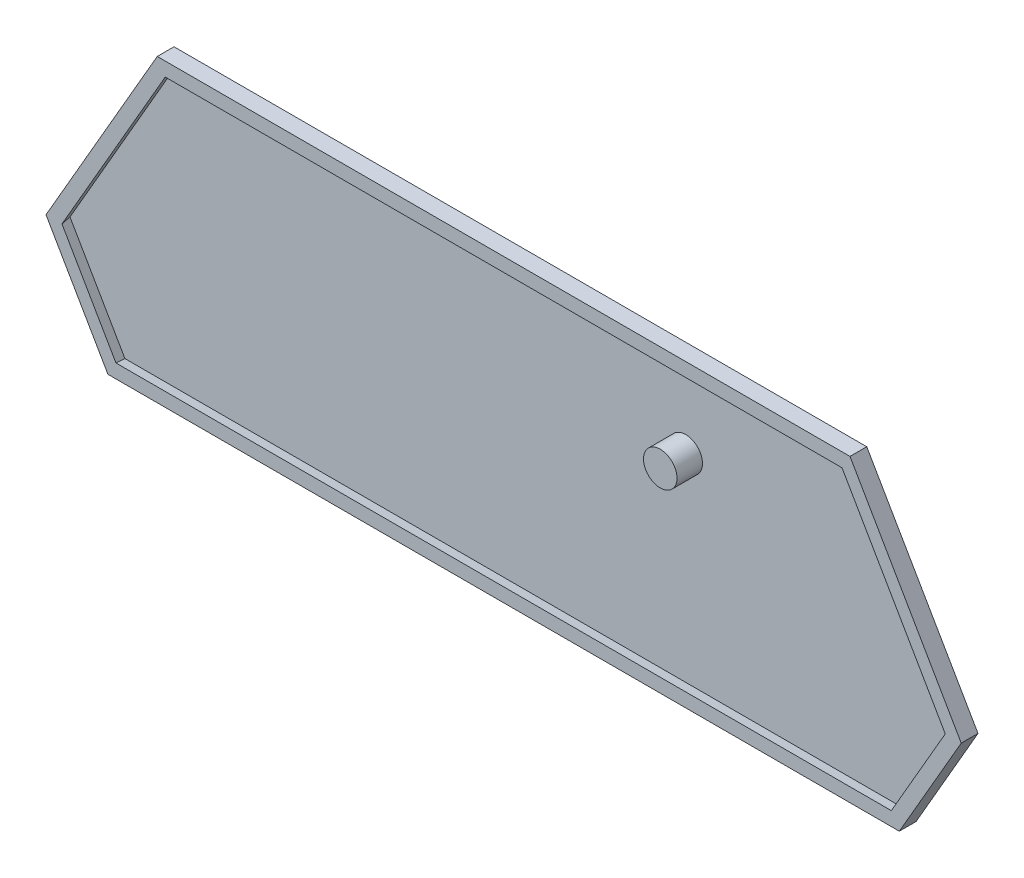
ISO-10303-21;
HEADER;
FILE_DESCRIPTION(('STEP AP214'),'2;1');
FILE_NAME('part.step','',(''),(''),'','','');
FILE_SCHEMA(('AUTOMOTIVE_DESIGN { 1 0 10303 214 1 1 1 1 }'));
ENDSEC;
DATA;
#1=APPLICATION_CONTEXT('core data for automotive mechanical design processes');
#2=APPLICATION_PROTOCOL_DEFINITION('international standard','automotive_design',2000,#1);
#3=PRODUCT_CONTEXT('',#1,'mechanical');
#4=PRODUCT('Part','Part','',(#3));
#5=PRODUCT_RELATED_PRODUCT_CATEGORY('part','',(#4));
#6=PRODUCT_DEFINITION_FORMATION('','',#4);
#7=PRODUCT_DEFINITION_CONTEXT('part definition',#1,'design');
#8=PRODUCT_DEFINITION('design','',#6,#7);
#9=PRODUCT_DEFINITION_SHAPE('','',#8);
#10=(LENGTH_UNIT() NAMED_UNIT(*) SI_UNIT(.MILLI.,.METRE.));
#11=(NAMED_UNIT(*) PLANE_ANGLE_UNIT() SI_UNIT($,.RADIAN.));
#12=(NAMED_UNIT(*) SI_UNIT($,.STERADIAN.) SOLID_ANGLE_UNIT());
#13=UNCERTAINTY_MEASURE_WITH_UNIT(LENGTH_MEASURE(1.E-05),#10,'distance_accuracy_value','');
#14=(GEOMETRIC_REPRESENTATION_CONTEXT(3) GLOBAL_UNCERTAINTY_ASSIGNED_CONTEXT((#13)) GLOBAL_UNIT_ASSIGNED_CONTEXT((#10,
#11,#12)) REPRESENTATION_CONTEXT('',''));
#15=CARTESIAN_POINT('',(0.,0.,0.));
#16=DIRECTION('',(0.,0.,1.));
#17=DIRECTION('',(1.,0.,0.));
#18=AXIS2_PLACEMENT_3D('',#15,#16,#17);
#19=CARTESIAN_POINT('',(0.,0.,2.5));
#20=DIRECTION('',(0.,0.,1.));
#21=DIRECTION('',(1.,0.,0.));
#22=AXIS2_PLACEMENT_3D('',#19,#20,#21);
#23=PLANE('',#22);
#24=DIRECTION('',(0.5,-0.866025403784438,0.));
#25=VECTOR('',#24,1.);
#26=CARTESIAN_POINT('',(-66.4744944991547,-27.7124006266647,2.5));
#27=LINE('',#26,#25);
#28=CARTESIAN_POINT('',(-65.878527434551,-28.7446458621961,2.5));
#29=VERTEX_POINT('',#28);
#30=CARTESIAN_POINT('',(-57.8328572567245,-42.6801553911334,2.5));
#31=VERTEX_POINT('',#30);
#32=EDGE_CURVE('E259',#29,#31,#27,.T.);
#33=ORIENTED_EDGE('',*,*,#32,.F.);
#34=DIRECTION('',(-0.499999999999999,-0.866025403784439,0.));
#35=VECTOR('',#34,1.);
#36=CARTESIAN_POINT('',(-49.8787654728555,-1.03224523553143,2.5));
#37=LINE('',#36,#35);
#38=CARTESIAN_POINT('',(-50.4747325374592,-2.06449047106278,2.5));
#39=VERTEX_POINT('',#38);
#40=EDGE_CURVE('E237',#39,#29,#37,.T.);
#41=ORIENTED_EDGE('',*,*,#40,.F.);
#42=DIRECTION('',(-1.,0.,0.));
#43=VECTOR('',#42,1.);
#44=CARTESIAN_POINT('',(51.6666666666667,-2.06449047106266,2.5));
#45=LINE('',#44,#43);
#46=CARTESIAN_POINT('',(50.4747325374592,-2.06449047106267,2.5));
#47=VERTEX_POINT('',#46);
#48=EDGE_CURVE('E242',#47,#39,#45,.T.);
#49=ORIENTED_EDGE('',*,*,#48,.F.);
#50=DIRECTION('',(-0.500000000000001,0.866025403784438,0.));
#51=VECTOR('',#50,1.);
#52=CARTESIAN_POINT('',(66.4744944991548,-29.7768910977273,2.5));
#53=LINE('',#52,#51);
#54=CARTESIAN_POINT('',(65.8785274345511,-28.744645862196,2.5));
#55=VERTEX_POINT('',#54);
#56=EDGE_CURVE('E261',#55,#47,#53,.T.);
#57=ORIENTED_EDGE('',*,*,#56,.F.);
#58=DIRECTION('',(0.499999999999998,0.86602540378444,0.));
#59=VECTOR('',#58,1.);
#60=CARTESIAN_POINT('',(57.2368901921209,-43.7124006266646,2.5));
#61=LINE('',#60,#59);
#62=CARTESIAN_POINT('',(57.8328572567246,-42.6801553911333,2.5));
#63=VERTEX_POINT('',#62);
#64=EDGE_CURVE('E264',#63,#55,#61,.T.);
#65=ORIENTED_EDGE('',*,*,#64,.F.);
#66=DIRECTION('',(1.,0.,0.));
#67=VECTOR('',#66,1.);
#68=CARTESIAN_POINT('',(-59.0247913859319,-42.6801553911334,2.5));
#69=LINE('',#68,#67);
#70=EDGE_CURVE('E266',#31,#63,#69,.T.);
#71=ORIENTED_EDGE('',*,*,#70,.F.);
#72=EDGE_LOOP('',(#33,#41,#49,#57,#65,#71));
#73=FACE_BOUND('',#72,.T.);
#74=DIRECTION('',(-0.5,0.866025403784438,0.));
#75=VECTOR('',#74,1.);
#76=CARTESIAN_POINT('',(-59.0247913859319,-44.7446458621961,2.5));
#77=LINE('',#76,#75);
#78=CARTESIAN_POINT('',(-59.0247913859319,-44.7446458621961,2.5));
#79=VERTEX_POINT('',#78);
#80=CARTESIAN_POINT('',(-68.262395692966,-28.7446458621961,2.5));
#81=VERTEX_POINT('',#80);
#82=EDGE_CURVE('E214',#79,#81,#77,.T.);
#83=ORIENTED_EDGE('',*,*,#82,.F.);
#84=DIRECTION('',(-1.,0.,0.));
#85=VECTOR('',#84,1.);
#86=CARTESIAN_POINT('',(59.0247913859321,-44.744645862196,2.5));
#87=LINE('',#86,#85);
#88=CARTESIAN_POINT('',(59.0247913859321,-44.744645862196,2.5));
#89=VERTEX_POINT('',#88);
#90=EDGE_CURVE('E295',#89,#79,#87,.T.);
#91=ORIENTED_EDGE('',*,*,#90,.F.);
#92=DIRECTION('',(-0.499999999999998,-0.86602540378444,0.));
#93=VECTOR('',#92,1.);
#94=CARTESIAN_POINT('',(68.262395692966,-28.744645862196,2.5));
#95=LINE('',#94,#93);
#96=CARTESIAN_POINT('',(68.262395692966,-28.744645862196,2.5));
#97=VERTEX_POINT('',#96);
#98=EDGE_CURVE('E220',#97,#89,#95,.T.);
#99=ORIENTED_EDGE('',*,*,#98,.F.);
#100=DIRECTION('',(0.500000000000001,-0.866025403784438,0.));
#101=VECTOR('',#100,1.);
#102=CARTESIAN_POINT('',(51.6666666666667,0.,2.5));
#103=LINE('',#102,#101);
#104=CARTESIAN_POINT('',(51.6666666666667,0.,2.5));
#105=VERTEX_POINT('',#104);
#106=EDGE_CURVE('E218',#105,#97,#103,.T.);
#107=ORIENTED_EDGE('',*,*,#106,.F.);
#108=DIRECTION('',(1.,0.,0.));
#109=VECTOR('',#108,1.);
#110=CARTESIAN_POINT('',(-51.6666666666667,0.,2.5));
#111=LINE('',#110,#109);
#112=CARTESIAN_POINT('',(-51.6666666666667,0.,2.5));
#113=VERTEX_POINT('',#112);
#114=EDGE_CURVE('E199',#113,#105,#111,.T.);
#115=ORIENTED_EDGE('',*,*,#114,.F.);
#116=DIRECTION('',(0.499999999999999,0.866025403784439,0.));
#117=VECTOR('',#116,1.);
#118=CARTESIAN_POINT('',(-68.2623956929659,-28.7446458621961,2.5));
#119=LINE('',#118,#117);
#120=EDGE_CURVE('E209',#81,#113,#119,.T.);
#121=ORIENTED_EDGE('',*,*,#120,.F.);
#122=EDGE_LOOP('',(#83,#91,#99,#107,#115,#121));
#123=FACE_BOUND('',#122,.T.);
#124=ADVANCED_FACE('F105',(#73,#123),#23,.T.);
#125=CARTESIAN_POINT('',(-50.1078209398547,-0.900000000000085,1.));
#126=DIRECTION('',(0.852868531952444,-0.492403876506103,-0.173648177666931));
#127=DIRECTION('',(0.499999999999999,0.866025403784439,0.));
#128=AXIS2_PLACEMENT_3D('',#125,#126,#127);
#129=PLANE('',#128);
#130=DIRECTION('',(-0.499999999999999,-0.866025403784439,0.));
#131=VECTOR('',#130,1.);
#132=CARTESIAN_POINT('',(-50.1078209398547,-0.900000000000085,1.));
#133=LINE('',#132,#131);
#134=CARTESIAN_POINT('',(-50.6274361821253,-1.80000000000009,1.));
#135=VERTEX_POINT('',#134);
#136=CARTESIAN_POINT('',(-66.1839347238833,-28.7446458621961,1.));
#137=VERTEX_POINT('',#136);
#138=EDGE_CURVE('E126',#135,#137,#133,.T.);
#139=ORIENTED_EDGE('',*,*,#138,.F.);
#140=DIRECTION('',(-0.0997557416394323,0.17278201286621,-0.97989548832509));
#141=VECTOR('',#140,1.);
#142=CARTESIAN_POINT('',(-50.6377777808266,-1.78208782561803,0.898415011077203));
#143=LINE('',#142,#141);
#144=EDGE_CURVE('E238',#39,#135,#143,.T.);
#145=ORIENTED_EDGE('',*,*,#144,.F.);
#146=ORIENTED_EDGE('',*,*,#40,.T.);
#147=DIRECTION('',(-0.199511483278864,0.,-0.979895488325091));
#148=VECTOR('',#147,1.);
#149=CARTESIAN_POINT('',(-66.2046179212858,-28.7446458621961,0.898415011077204));
#150=LINE('',#149,#148);
#151=EDGE_CURVE('E243',#29,#137,#150,.T.);
#152=ORIENTED_EDGE('',*,*,#151,.T.);
#153=EDGE_LOOP('',(#139,#145,#146,#152));
#154=FACE_BOUND('',#153,.T.);
#155=ADVANCED_FACE('F320',(#154),#129,.T.);
#156=CARTESIAN_POINT('',(-66.7035499661539,-27.8446458621961,1.));
#157=DIRECTION('',(0.852868531952443,0.492403876506104,-0.173648177666931));
#158=DIRECTION('',(-0.5,0.866025403784438,0.));
#159=AXIS2_PLACEMENT_3D('',#156,#157,#158);
#160=PLANE('',#159);
#161=DIRECTION('',(0.5,-0.866025403784438,0.));
#162=VECTOR('',#161,1.);
#163=CARTESIAN_POINT('',(-66.7035499661539,-27.8446458621961,1.));
#164=LINE('',#163,#162);
#165=CARTESIAN_POINT('',(-57.9855609013906,-42.9446458621961,1.));
#166=VERTEX_POINT('',#165);
#167=EDGE_CURVE('E227',#137,#166,#164,.T.);
#168=ORIENTED_EDGE('',*,*,#167,.F.);
#169=ORIENTED_EDGE('',*,*,#151,.F.);
#170=ORIENTED_EDGE('',*,*,#32,.T.);
#171=DIRECTION('',(-0.0997557416394319,-0.172782012866211,-0.97989548832509));
#172=VECTOR('',#171,1.);
#173=CARTESIAN_POINT('',(-57.9959025000918,-42.9625580365782,0.898415011077204));
#174=LINE('',#173,#172);
#175=EDGE_CURVE('E247',#31,#166,#174,.T.);
#176=ORIENTED_EDGE('',*,*,#175,.T.);
#177=EDGE_LOOP('',(#168,#169,#170,#176));
#178=FACE_BOUND('',#177,.T.);
#179=ADVANCED_FACE('F326',(#178),#160,.T.);
#180=CARTESIAN_POINT('',(-59.0247913859319,-42.9446458621961,1.));
#181=DIRECTION('',(0.,0.984807753012208,-0.173648177666931));
#182=DIRECTION('',(0.,0.173648177666931,0.984807753012208));
#183=AXIS2_PLACEMENT_3D('',#180,#181,#182);
#184=PLANE('',#183);
#185=DIRECTION('',(1.,0.,0.));
#186=VECTOR('',#185,1.);
#187=CARTESIAN_POINT('',(-59.0247913859319,-42.9446458621961,1.));
#188=LINE('',#187,#186);
#189=CARTESIAN_POINT('',(57.9855609013907,-42.944645862196,1.));
#190=VERTEX_POINT('',#189);
#191=EDGE_CURVE('E229',#166,#190,#188,.T.);
#192=ORIENTED_EDGE('',*,*,#191,.F.);
#193=ORIENTED_EDGE('',*,*,#175,.F.);
#194=ORIENTED_EDGE('',*,*,#70,.T.);
#195=DIRECTION('',(0.0997557416394323,-0.17278201286621,-0.979895488325091));
#196=VECTOR('',#195,1.);
#197=CARTESIAN_POINT('',(57.995902500092,-42.9625580365781,0.898415011077203));
#198=LINE('',#197,#196);
#199=EDGE_CURVE('E250',#63,#190,#198,.T.);
#200=ORIENTED_EDGE('',*,*,#199,.T.);
#201=EDGE_LOOP('',(#192,#193,#194,#200));
#202=FACE_BOUND('',#201,.T.);
#203=ADVANCED_FACE('F335',(#202),#184,.T.);
#204=CARTESIAN_POINT('',(57.4659456591201,-43.844645862196,1.));
#205=DIRECTION('',(-0.852868531952444,0.492403876506102,-0.173648177666931));
#206=DIRECTION('',(-0.499999999999998,-0.86602540378444,0.));
#207=AXIS2_PLACEMENT_3D('',#204,#205,#206);
#208=PLANE('',#207);
#209=DIRECTION('',(0.499999999999998,0.86602540378444,0.));
#210=VECTOR('',#209,1.);
#211=CARTESIAN_POINT('',(57.4659456591201,-43.844645862196,1.));
#212=LINE('',#211,#210);
#213=CARTESIAN_POINT('',(66.1839347238834,-28.744645862196,1.));
#214=VERTEX_POINT('',#213);
#215=EDGE_CURVE('E231',#190,#214,#212,.T.);
#216=ORIENTED_EDGE('',*,*,#215,.F.);
#217=ORIENTED_EDGE('',*,*,#199,.F.);
#218=ORIENTED_EDGE('',*,*,#64,.T.);
#219=DIRECTION('',(0.199511483278864,0.,-0.979895488325091));
#220=VECTOR('',#219,1.);
#221=CARTESIAN_POINT('',(66.2046179212859,-28.744645862196,0.898415011077204));
#222=LINE('',#221,#220);
#223=EDGE_CURVE('E253',#55,#214,#222,.T.);
#224=ORIENTED_EDGE('',*,*,#223,.T.);
#225=EDGE_LOOP('',(#216,#217,#218,#224));
#226=FACE_BOUND('',#225,.T.);
#227=ADVANCED_FACE('F339',(#226),#208,.T.);
#228=CARTESIAN_POINT('',(66.703549966154,-29.644645862196,1.));
#229=DIRECTION('',(-0.852868531952443,-0.492403876506105,-0.173648177666931));
#230=DIRECTION('',(0.500000000000001,-0.866025403784438,0.));
#231=AXIS2_PLACEMENT_3D('',#228,#229,#230);
#232=PLANE('',#231);
#233=DIRECTION('',(-0.500000000000001,0.866025403784438,0.));
#234=VECTOR('',#233,1.);
#235=CARTESIAN_POINT('',(66.703549966154,-29.644645862196,1.));
#236=LINE('',#235,#234);
#237=CARTESIAN_POINT('',(50.6274361821253,-1.79999999999997,1.));
#238=VERTEX_POINT('',#237);
#239=EDGE_CURVE('E233',#214,#238,#236,.T.);
#240=ORIENTED_EDGE('',*,*,#239,.F.);
#241=ORIENTED_EDGE('',*,*,#223,.F.);
#242=ORIENTED_EDGE('',*,*,#56,.T.);
#243=DIRECTION('',(0.0997557416394318,0.172782012866211,-0.979895488325091));
#244=VECTOR('',#243,1.);
#245=CARTESIAN_POINT('',(50.6377777808266,-1.78208782561791,0.898415011077203));
#246=LINE('',#245,#244);
#247=EDGE_CURVE('E241',#47,#238,#246,.T.);
#248=ORIENTED_EDGE('',*,*,#247,.T.);
#249=EDGE_LOOP('',(#240,#241,#242,#248));
#250=FACE_BOUND('',#249,.T.);
#251=ADVANCED_FACE('F316',(#250),#232,.T.);
#252=CARTESIAN_POINT('',(51.6666666666667,-1.79999999999997,1.));
#253=DIRECTION('',(0.,-0.984807753012208,-0.173648177666931));
#254=DIRECTION('',(0.,0.173648177666931,-0.984807753012208));
#255=AXIS2_PLACEMENT_3D('',#252,#253,#254);
#256=PLANE('',#255);
#257=DIRECTION('',(-1.,0.,0.));
#258=VECTOR('',#257,1.);
#259=CARTESIAN_POINT('',(51.6666666666667,-1.79999999999997,1.));
#260=LINE('',#259,#258);
#261=EDGE_CURVE('E235',#238,#135,#260,.T.);
#262=ORIENTED_EDGE('',*,*,#261,.F.);
#263=ORIENTED_EDGE('',*,*,#247,.F.);
#264=ORIENTED_EDGE('',*,*,#48,.T.);
#265=ORIENTED_EDGE('',*,*,#144,.T.);
#266=EDGE_LOOP('',(#262,#263,#264,#265));
#267=FACE_BOUND('',#266,.T.);
#268=ADVANCED_FACE('F309',(#267),#256,.T.);
#269=CARTESIAN_POINT('',(0.,0.,1.));
#270=DIRECTION('',(0.,0.,1.));
#271=DIRECTION('',(1.,0.,0.));
#272=AXIS2_PLACEMENT_3D('',#269,#270,#271);
#273=PLANE('',#272);
#274=CARTESIAN_POINT('',(25.665479370752,-13.4245413062782,1.));
#275=DIRECTION('',(0.,0.,1.));
#276=DIRECTION('',(1.,0.,0.));
#277=AXIS2_PLACEMENT_3D('',#274,#275,#276);
#278=CIRCLE('',#277,2.5);
#279=CARTESIAN_POINT('',(28.165479370752,-13.4245413062782,1.));
#280=VERTEX_POINT('',#279);
#281=EDGE_CURVE('E299',#280,#280,#278,.T.);
#282=ORIENTED_EDGE('',*,*,#281,.F.);
#283=EDGE_LOOP('',(#282));
#284=FACE_BOUND('',#283,.T.);
#285=ORIENTED_EDGE('',*,*,#138,.T.);
#286=ORIENTED_EDGE('',*,*,#167,.T.);
#287=ORIENTED_EDGE('',*,*,#191,.T.);
#288=ORIENTED_EDGE('',*,*,#215,.T.);
#289=ORIENTED_EDGE('',*,*,#239,.T.);
#290=ORIENTED_EDGE('',*,*,#261,.T.);
#291=EDGE_LOOP('',(#285,#286,#287,#288,#289,#290));
#292=FACE_BOUND('',#291,.T.);
#293=ADVANCED_FACE('F307',(#284,#292),#273,.T.);
#294=CARTESIAN_POINT('',(0.,0.,0.));
#295=DIRECTION('',(0.,0.,1.));
#296=DIRECTION('',(1.,0.,0.));
#297=AXIS2_PLACEMENT_3D('',#294,#295,#296);
#298=PLANE('',#297);
#299=DIRECTION('',(0.5,-0.866025403784438,0.));
#300=VECTOR('',#299,1.);
#301=CARTESIAN_POINT('',(-68.2623956929659,-28.7446458621961,0.));
#302=LINE('',#301,#300);
#303=CARTESIAN_POINT('',(-68.2623956929659,-28.7446458621961,0.));
#304=VERTEX_POINT('',#303);
#305=CARTESIAN_POINT('',(-59.0247913859319,-44.7446458621961,0.));
#306=VERTEX_POINT('',#305);
#307=EDGE_CURVE('E246',#304,#306,#302,.T.);
#308=ORIENTED_EDGE('',*,*,#307,.F.);
#309=DIRECTION('',(-0.499999999999999,-0.866025403784439,0.));
#310=VECTOR('',#309,1.);
#311=CARTESIAN_POINT('',(-51.6666666666667,0.,0.));
#312=LINE('',#311,#310);
#313=CARTESIAN_POINT('',(-51.6666666666667,0.,0.));
#314=VERTEX_POINT('',#313);
#315=EDGE_CURVE('E277',#314,#304,#312,.T.);
#316=ORIENTED_EDGE('',*,*,#315,.F.);
#317=DIRECTION('',(-1.,0.,0.));
#318=VECTOR('',#317,1.);
#319=CARTESIAN_POINT('',(51.6666666666667,0.,0.));
#320=LINE('',#319,#318);
#321=CARTESIAN_POINT('',(51.6666666666667,0.,0.));
#322=VERTEX_POINT('',#321);
#323=EDGE_CURVE('E202',#322,#314,#320,.T.);
#324=ORIENTED_EDGE('',*,*,#323,.F.);
#325=DIRECTION('',(-0.500000000000001,0.866025403784438,0.));
#326=VECTOR('',#325,1.);
#327=CARTESIAN_POINT('',(68.262395692966,-28.744645862196,0.));
#328=LINE('',#327,#326);
#329=CARTESIAN_POINT('',(68.262395692966,-28.744645862196,0.));
#330=VERTEX_POINT('',#329);
#331=EDGE_CURVE('E274',#330,#322,#328,.T.);
#332=ORIENTED_EDGE('',*,*,#331,.F.);
#333=DIRECTION('',(0.499999999999998,0.86602540378444,0.));
#334=VECTOR('',#333,1.);
#335=CARTESIAN_POINT('',(59.0247913859321,-44.744645862196,0.));
#336=LINE('',#335,#334);
#337=CARTESIAN_POINT('',(59.0247913859321,-44.744645862196,0.));
#338=VERTEX_POINT('',#337);
#339=EDGE_CURVE('E272',#338,#330,#336,.T.);
#340=ORIENTED_EDGE('',*,*,#339,.F.);
#341=DIRECTION('',(1.,0.,0.));
#342=VECTOR('',#341,1.);
#343=CARTESIAN_POINT('',(2.70000000000004,-44.744645862196,0.));
#344=LINE('',#343,#342);
#345=EDGE_CURVE('E270',#306,#338,#344,.T.);
#346=ORIENTED_EDGE('',*,*,#345,.F.);
#347=EDGE_LOOP('',(#308,#316,#324,#332,#340,#346));
#348=FACE_BOUND('',#347,.T.);
#349=ADVANCED_FACE('F292',(#348),#298,.F.);
#350=CARTESIAN_POINT('',(51.6666666666667,0.,1.));
#351=DIRECTION('',(0.,-1.,0.));
#352=DIRECTION('',(1.,0.,0.));
#353=AXIS2_PLACEMENT_3D('',#350,#351,#352);
#354=PLANE('',#353);
#355=ORIENTED_EDGE('',*,*,#323,.T.);
#356=DIRECTION('',(0.,0.,-1.));
#357=VECTOR('',#356,1.);
#358=CARTESIAN_POINT('',(-51.6666666666667,0.,1.));
#359=LINE('',#358,#357);
#360=EDGE_CURVE('E194',#113,#314,#359,.T.);
#361=ORIENTED_EDGE('',*,*,#360,.F.);
#362=ORIENTED_EDGE('',*,*,#114,.T.);
#363=DIRECTION('',(0.,0.,-1.));
#364=VECTOR('',#363,1.);
#365=CARTESIAN_POINT('',(51.6666666666667,0.,1.));
#366=LINE('',#365,#364);
#367=EDGE_CURVE('E205',#105,#322,#366,.T.);
#368=ORIENTED_EDGE('',*,*,#367,.T.);
#369=EDGE_LOOP('',(#355,#361,#362,#368));
#370=FACE_BOUND('',#369,.T.);
#371=ADVANCED_FACE('F196',(#370),#354,.F.);
#372=CARTESIAN_POINT('',(68.262395692966,-28.744645862196,1.));
#373=DIRECTION('',(-0.866025403784438,-0.500000000000001,0.));
#374=DIRECTION('',(0.500000000000001,-0.866025403784438,0.));
#375=AXIS2_PLACEMENT_3D('',#372,#373,#374);
#376=PLANE('',#375);
#377=ORIENTED_EDGE('',*,*,#331,.T.);
#378=ORIENTED_EDGE('',*,*,#367,.F.);
#379=ORIENTED_EDGE('',*,*,#106,.T.);
#380=DIRECTION('',(0.,0.,-1.));
#381=VECTOR('',#380,1.);
#382=CARTESIAN_POINT('',(68.262395692966,-28.744645862196,1.));
#383=LINE('',#382,#381);
#384=EDGE_CURVE('E281',#97,#330,#383,.T.);
#385=ORIENTED_EDGE('',*,*,#384,.T.);
#386=EDGE_LOOP('',(#377,#378,#379,#385));
#387=FACE_BOUND('',#386,.T.);
#388=ADVANCED_FACE('F294',(#387),#376,.F.);
#389=CARTESIAN_POINT('',(59.0247913859321,-44.744645862196,1.));
#390=DIRECTION('',(-0.86602540378444,0.499999999999998,0.));
#391=DIRECTION('',(-0.499999999999998,-0.86602540378444,0.));
#392=AXIS2_PLACEMENT_3D('',#389,#390,#391);
#393=PLANE('',#392);
#394=ORIENTED_EDGE('',*,*,#339,.T.);
#395=ORIENTED_EDGE('',*,*,#384,.F.);
#396=ORIENTED_EDGE('',*,*,#98,.T.);
#397=DIRECTION('',(0.,0.,-1.));
#398=VECTOR('',#397,1.);
#399=CARTESIAN_POINT('',(59.0247913859321,-44.744645862196,1.));
#400=LINE('',#399,#398);
#401=EDGE_CURVE('E113',#89,#338,#400,.T.);
#402=ORIENTED_EDGE('',*,*,#401,.T.);
#403=EDGE_LOOP('',(#394,#395,#396,#402));
#404=FACE_BOUND('',#403,.T.);
#405=ADVANCED_FACE('F286',(#404),#393,.F.);
#406=CARTESIAN_POINT('',(2.70000000000004,-44.744645862196,1.));
#407=DIRECTION('',(0.,1.,0.));
#408=DIRECTION('',(-1.,0.,0.));
#409=AXIS2_PLACEMENT_3D('',#406,#407,#408);
#410=PLANE('',#409);
#411=ORIENTED_EDGE('',*,*,#345,.T.);
#412=ORIENTED_EDGE('',*,*,#401,.F.);
#413=ORIENTED_EDGE('',*,*,#90,.T.);
#414=DIRECTION('',(0.,0.,-1.));
#415=VECTOR('',#414,1.);
#416=CARTESIAN_POINT('',(-59.0247913859319,-44.7446458621961,1.));
#417=LINE('',#416,#415);
#418=EDGE_CURVE('E12',#79,#306,#417,.T.);
#419=ORIENTED_EDGE('',*,*,#418,.T.);
#420=EDGE_LOOP('',(#411,#412,#413,#419));
#421=FACE_BOUND('',#420,.T.);
#422=ADVANCED_FACE('F399',(#421),#410,.F.);
#423=CARTESIAN_POINT('',(-68.2623956929659,-28.7446458621961,1.));
#424=DIRECTION('',(0.866025403784438,0.5,0.));
#425=DIRECTION('',(-0.5,0.866025403784438,0.));
#426=AXIS2_PLACEMENT_3D('',#423,#424,#425);
#427=PLANE('',#426);
#428=ORIENTED_EDGE('',*,*,#307,.T.);
#429=ORIENTED_EDGE('',*,*,#418,.F.);
#430=ORIENTED_EDGE('',*,*,#82,.T.);
#431=DIRECTION('',(0.,0.,-1.));
#432=VECTOR('',#431,1.);
#433=CARTESIAN_POINT('',(-68.2623956929659,-28.7446458621961,1.));
#434=LINE('',#433,#432);
#435=EDGE_CURVE('E206',#81,#304,#434,.T.);
#436=ORIENTED_EDGE('',*,*,#435,.T.);
#437=EDGE_LOOP('',(#428,#429,#430,#436));
#438=FACE_BOUND('',#437,.T.);
#439=ADVANCED_FACE('F107',(#438),#427,.F.);
#440=CARTESIAN_POINT('',(-51.6666666666667,0.,1.));
#441=DIRECTION('',(0.866025403784439,-0.499999999999999,0.));
#442=DIRECTION('',(0.499999999999999,0.866025403784439,0.));
#443=AXIS2_PLACEMENT_3D('',#440,#441,#442);
#444=PLANE('',#443);
#445=ORIENTED_EDGE('',*,*,#315,.T.);
#446=ORIENTED_EDGE('',*,*,#435,.F.);
#447=ORIENTED_EDGE('',*,*,#120,.T.);
#448=ORIENTED_EDGE('',*,*,#360,.T.);
#449=EDGE_LOOP('',(#445,#446,#447,#448));
#450=FACE_BOUND('',#449,.T.);
#451=ADVANCED_FACE('F210',(#450),#444,.F.);
#452=CARTESIAN_POINT('',(25.665479370752,-13.4245413062782,4.8));
#453=DIRECTION('',(0.,0.,-1.));
#454=DIRECTION('',(-1.,0.,0.));
#455=AXIS2_PLACEMENT_3D('',#452,#453,#454);
#456=CYLINDRICAL_SURFACE('',#455,2.5);
#457=CARTESIAN_POINT('',(25.665479370752,-13.4245413062782,4.8));
#458=DIRECTION('',(0.,0.,1.));
#459=DIRECTION('',(1.,0.,0.));
#460=AXIS2_PLACEMENT_3D('',#457,#458,#459);
#461=CIRCLE('',#460,2.5);
#462=CARTESIAN_POINT('',(28.165479370752,-13.4245413062782,4.8));
#463=VERTEX_POINT('',#462);
#464=EDGE_CURVE('E296',#463,#463,#461,.T.);
#465=ORIENTED_EDGE('',*,*,#464,.F.);
#466=EDGE_LOOP('',(#465));
#467=FACE_BOUND('',#466,.T.);
#468=ORIENTED_EDGE('',*,*,#281,.T.);
#469=EDGE_LOOP('',(#468));
#470=FACE_BOUND('',#469,.T.);
#471=ADVANCED_FACE('F305',(#467,#470),#456,.T.);
#472=CARTESIAN_POINT('',(25.665479370752,-13.4245413062782,4.8));
#473=DIRECTION('',(0.,0.,1.));
#474=DIRECTION('',(1.,0.,0.));
#475=AXIS2_PLACEMENT_3D('',#472,#473,#474);
#476=PLANE('',#475);
#477=ORIENTED_EDGE('',*,*,#464,.T.);
#478=EDGE_LOOP('',(#477));
#479=FACE_BOUND('',#478,.T.);
#480=ADVANCED_FACE('F439',(#479),#476,.T.);
#481=CLOSED_SHELL('',(#124,#155,#179,#203,#227,#251,#268,#293,#349,#371,#388,#405,#422,#439,
#451,#471,#480));
#482=MANIFOLD_SOLID_BREP('B2',#481);
#483=ADVANCED_BREP_SHAPE_REPRESENTATION('',(#18,#482),#14);
#484=SHAPE_DEFINITION_REPRESENTATION(#9,#483);
ENDSEC;
END-ISO-10303-21;
